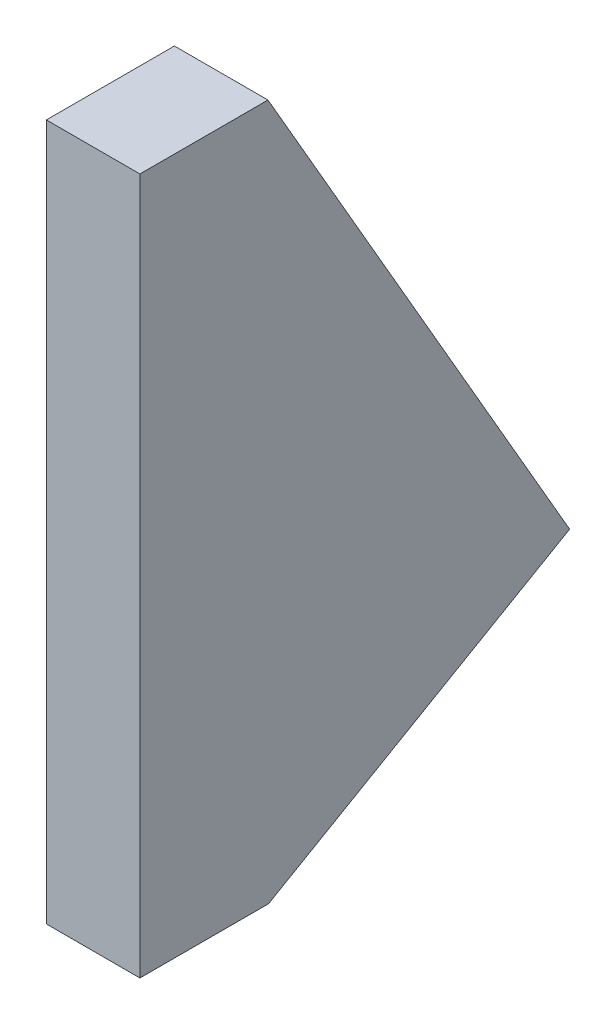
ISO-10303-21;
HEADER;
FILE_DESCRIPTION(('STEP AP214'),'2;1');
FILE_NAME('part.step','',(''),(''),'','','');
FILE_SCHEMA(('AUTOMOTIVE_DESIGN { 1 0 10303 214 1 1 1 1 }'));
ENDSEC;
DATA;
#1=APPLICATION_CONTEXT('core data for automotive mechanical design processes');
#2=APPLICATION_PROTOCOL_DEFINITION('international standard','automotive_design',2000,#1);
#3=PRODUCT_CONTEXT('',#1,'mechanical');
#4=PRODUCT('Part','Part','',(#3));
#5=PRODUCT_RELATED_PRODUCT_CATEGORY('part','',(#4));
#6=PRODUCT_DEFINITION_FORMATION('','',#4);
#7=PRODUCT_DEFINITION_CONTEXT('part definition',#1,'design');
#8=PRODUCT_DEFINITION('design','',#6,#7);
#9=PRODUCT_DEFINITION_SHAPE('','',#8);
#10=(LENGTH_UNIT() NAMED_UNIT(*) SI_UNIT(.MILLI.,.METRE.));
#11=(NAMED_UNIT(*) PLANE_ANGLE_UNIT() SI_UNIT($,.RADIAN.));
#12=(NAMED_UNIT(*) SI_UNIT($,.STERADIAN.) SOLID_ANGLE_UNIT());
#13=UNCERTAINTY_MEASURE_WITH_UNIT(LENGTH_MEASURE(1.E-05),#10,'distance_accuracy_value','');
#14=(GEOMETRIC_REPRESENTATION_CONTEXT(3) GLOBAL_UNCERTAINTY_ASSIGNED_CONTEXT((#13)) GLOBAL_UNIT_ASSIGNED_CONTEXT((#10,
#11,#12)) REPRESENTATION_CONTEXT('',''));
#15=CARTESIAN_POINT('',(0.,0.,0.));
#16=DIRECTION('',(0.,0.,1.));
#17=DIRECTION('',(1.,0.,0.));
#18=AXIS2_PLACEMENT_3D('',#15,#16,#17);
#19=CARTESIAN_POINT('',(3.175,-11.81399897,-0.0635));
#20=DIRECTION('',(0.,1.,0.));
#21=DIRECTION('',(0.,0.,1.));
#22=AXIS2_PLACEMENT_3D('',#19,#20,#21);
#23=PLANE('',#22);
#24=DIRECTION('',(0.,0.,-1.));
#25=VECTOR('',#24,1.);
#26=CARTESIAN_POINT('',(0.,-11.81399897,-0.0635));
#27=LINE('',#26,#25);
#28=CARTESIAN_POINT('',(0.,-11.81399897,-0.0635));
#29=VERTEX_POINT('',#28);
#30=CARTESIAN_POINT('',(0.,-11.81399897,-4.42798522627235));
#31=VERTEX_POINT('',#30);
#32=EDGE_CURVE('E112',#29,#31,#27,.T.);
#33=ORIENTED_EDGE('',*,*,#32,.T.);
#34=DIRECTION('',(-1.,0.,0.));
#35=VECTOR('',#34,1.);
#36=CARTESIAN_POINT('',(3.175,-11.81399897,-4.42798522627235));
#37=LINE('',#36,#35);
#38=CARTESIAN_POINT('',(3.175,-11.81399897,-4.42798522627235));
#39=VERTEX_POINT('',#38);
#40=EDGE_CURVE('E11',#39,#31,#37,.T.);
#41=ORIENTED_EDGE('',*,*,#40,.F.);
#42=DIRECTION('',(0.,0.,-1.));
#43=VECTOR('',#42,1.);
#44=CARTESIAN_POINT('',(3.175,-11.81399897,-0.0635));
#45=LINE('',#44,#43);
#46=CARTESIAN_POINT('',(3.175,-11.81399897,-0.0635));
#47=VERTEX_POINT('',#46);
#48=EDGE_CURVE('E122',#47,#39,#45,.T.);
#49=ORIENTED_EDGE('',*,*,#48,.F.);
#50=DIRECTION('',(-1.,0.,0.));
#51=VECTOR('',#50,1.);
#52=CARTESIAN_POINT('',(3.175,-11.81399897,-0.0635));
#53=LINE('',#52,#51);
#54=EDGE_CURVE('E53',#47,#29,#53,.T.);
#55=ORIENTED_EDGE('',*,*,#54,.T.);
#56=EDGE_LOOP('',(#33,#41,#49,#55));
#57=FACE_BOUND('',#56,.T.);
#58=ADVANCED_FACE('F37',(#57),#23,.F.);
#59=CARTESIAN_POINT('',(3.175,-11.81399897,-4.42798522627235));
#60=DIRECTION('',(0.,0.866025403662906,0.500000000210501));
#61=DIRECTION('',(0.,-0.500000000210501,0.866025403662906));
#62=AXIS2_PLACEMENT_3D('',#59,#60,#61);
#63=PLANE('',#62);
#64=DIRECTION('',(0.,0.500000000210501,-0.866025403662906));
#65=VECTOR('',#64,1.);
#66=CARTESIAN_POINT('',(0.,-11.81399897,-4.42798522627235));
#67=LINE('',#66,#65);
#68=CARTESIAN_POINT('',(0.,-5.91550686937283,-14.6444732268674));
#69=VERTEX_POINT('',#68);
#70=EDGE_CURVE('E114',#31,#69,#67,.T.);
#71=ORIENTED_EDGE('',*,*,#70,.T.);
#72=DIRECTION('',(-1.,0.,0.));
#73=VECTOR('',#72,1.);
#74=CARTESIAN_POINT('',(3.175,-5.91550686937283,-14.6444732268674));
#75=LINE('',#74,#73);
#76=CARTESIAN_POINT('',(3.175,-5.91550686937283,-14.6444732268674));
#77=VERTEX_POINT('',#76);
#78=EDGE_CURVE('E45',#77,#69,#75,.T.);
#79=ORIENTED_EDGE('',*,*,#78,.F.);
#80=DIRECTION('',(0.,0.500000000210501,-0.866025403662906));
#81=VECTOR('',#80,1.);
#82=CARTESIAN_POINT('',(3.175,-11.81399897,-4.42798522627235));
#83=LINE('',#82,#81);
#84=EDGE_CURVE('E83',#39,#77,#83,.T.);
#85=ORIENTED_EDGE('',*,*,#84,.F.);
#86=ORIENTED_EDGE('',*,*,#40,.T.);
#87=EDGE_LOOP('',(#71,#79,#85,#86));
#88=FACE_BOUND('',#87,.T.);
#89=ADVANCED_FACE('F137',(#88),#63,.F.);
#90=CARTESIAN_POINT('',(3.175,-5.91550686937283,-14.6444732268674));
#91=DIRECTION('',(0.,-0.5,0.866025403784438));
#92=DIRECTION('',(0.,-0.866025403784439,-0.5));
#93=AXIS2_PLACEMENT_3D('',#90,#91,#92);
#94=PLANE('',#93);
#95=DIRECTION('',(0.,0.866025403784439,0.5));
#96=VECTOR('',#95,1.);
#97=CARTESIAN_POINT('',(0.,-5.91550686937283,-14.6444732268674));
#98=LINE('',#97,#96);
#99=CARTESIAN_POINT('',(0.,11.81399897,-4.40833825790645));
#100=VERTEX_POINT('',#99);
#101=EDGE_CURVE('E102',#69,#100,#98,.T.);
#102=ORIENTED_EDGE('',*,*,#101,.T.);
#103=DIRECTION('',(-1.,0.,0.));
#104=VECTOR('',#103,1.);
#105=CARTESIAN_POINT('',(3.175,11.81399897,-4.40833825790645));
#106=LINE('',#105,#104);
#107=CARTESIAN_POINT('',(3.175,11.81399897,-4.40833825790645));
#108=VERTEX_POINT('',#107);
#109=EDGE_CURVE('E99',#108,#100,#106,.T.);
#110=ORIENTED_EDGE('',*,*,#109,.F.);
#111=DIRECTION('',(0.,0.866025403784439,0.5));
#112=VECTOR('',#111,1.);
#113=CARTESIAN_POINT('',(3.175,-5.91550686937283,-14.6444732268674));
#114=LINE('',#113,#112);
#115=EDGE_CURVE('E89',#77,#108,#114,.T.);
#116=ORIENTED_EDGE('',*,*,#115,.F.);
#117=ORIENTED_EDGE('',*,*,#78,.T.);
#118=EDGE_LOOP('',(#102,#110,#116,#117));
#119=FACE_BOUND('',#118,.T.);
#120=ADVANCED_FACE('F100',(#119),#94,.F.);
#121=CARTESIAN_POINT('',(3.175,11.81399897,-4.40833825790645));
#122=DIRECTION('',(0.,-1.,0.));
#123=DIRECTION('',(0.,0.,-1.));
#124=AXIS2_PLACEMENT_3D('',#121,#122,#123);
#125=PLANE('',#124);
#126=DIRECTION('',(0.,0.,1.));
#127=VECTOR('',#126,1.);
#128=CARTESIAN_POINT('',(0.,11.81399897,-4.40833825790645));
#129=LINE('',#128,#127);
#130=CARTESIAN_POINT('',(0.,11.81399897,-0.0635));
#131=VERTEX_POINT('',#130);
#132=EDGE_CURVE('E117',#100,#131,#129,.T.);
#133=ORIENTED_EDGE('',*,*,#132,.T.);
#134=DIRECTION('',(-1.,0.,0.));
#135=VECTOR('',#134,1.);
#136=CARTESIAN_POINT('',(3.175,11.81399897,-0.0635));
#137=LINE('',#136,#135);
#138=CARTESIAN_POINT('',(3.175,11.81399897,-0.0635));
#139=VERTEX_POINT('',#138);
#140=EDGE_CURVE('E71',#139,#131,#137,.T.);
#141=ORIENTED_EDGE('',*,*,#140,.F.);
#142=DIRECTION('',(0.,0.,1.));
#143=VECTOR('',#142,1.);
#144=CARTESIAN_POINT('',(3.175,11.81399897,-4.40833825790645));
#145=LINE('',#144,#143);
#146=EDGE_CURVE('E94',#108,#139,#145,.T.);
#147=ORIENTED_EDGE('',*,*,#146,.F.);
#148=ORIENTED_EDGE('',*,*,#109,.T.);
#149=EDGE_LOOP('',(#133,#141,#147,#148));
#150=FACE_BOUND('',#149,.T.);
#151=ADVANCED_FACE('F106',(#150),#125,.F.);
#152=CARTESIAN_POINT('',(3.175,-11.81399897,-0.0635));
#153=DIRECTION('',(0.,0.,1.));
#154=DIRECTION('',(1.,0.,0.));
#155=AXIS2_PLACEMENT_3D('',#152,#153,#154);
#156=PLANE('',#155);
#157=DIRECTION('',(0.,1.,0.));
#158=VECTOR('',#157,1.);
#159=CARTESIAN_POINT('',(0.,-11.81399897,-0.0635));
#160=LINE('',#159,#158);
#161=EDGE_CURVE('E119',#29,#131,#160,.T.);
#162=ORIENTED_EDGE('',*,*,#161,.F.);
#163=ORIENTED_EDGE('',*,*,#54,.F.);
#164=DIRECTION('',(0.,1.,0.));
#165=VECTOR('',#164,1.);
#166=CARTESIAN_POINT('',(3.175,-11.81399897,-0.0635));
#167=LINE('',#166,#165);
#168=EDGE_CURVE('E107',#47,#139,#167,.T.);
#169=ORIENTED_EDGE('',*,*,#168,.T.);
#170=ORIENTED_EDGE('',*,*,#140,.T.);
#171=EDGE_LOOP('',(#162,#163,#169,#170));
#172=FACE_BOUND('',#171,.T.);
#173=ADVANCED_FACE('F126',(#172),#156,.T.);
#174=CARTESIAN_POINT('',(3.175,0.,0.));
#175=DIRECTION('',(1.,0.,0.));
#176=DIRECTION('',(0.,0.,-1.));
#177=AXIS2_PLACEMENT_3D('',#174,#175,#176);
#178=PLANE('',#177);
#179=ORIENTED_EDGE('',*,*,#48,.T.);
#180=ORIENTED_EDGE('',*,*,#84,.T.);
#181=ORIENTED_EDGE('',*,*,#115,.T.);
#182=ORIENTED_EDGE('',*,*,#146,.T.);
#183=ORIENTED_EDGE('',*,*,#168,.F.);
#184=EDGE_LOOP('',(#179,#180,#181,#182,#183));
#185=FACE_BOUND('',#184,.T.);
#186=ADVANCED_FACE('F91',(#185),#178,.T.);
#187=CARTESIAN_POINT('',(0.,0.,0.));
#188=DIRECTION('',(1.,0.,0.));
#189=DIRECTION('',(0.,0.,-1.));
#190=AXIS2_PLACEMENT_3D('',#187,#188,#189);
#191=PLANE('',#190);
#192=ORIENTED_EDGE('',*,*,#32,.F.);
#193=ORIENTED_EDGE('',*,*,#161,.T.);
#194=ORIENTED_EDGE('',*,*,#132,.F.);
#195=ORIENTED_EDGE('',*,*,#101,.F.);
#196=ORIENTED_EDGE('',*,*,#70,.F.);
#197=EDGE_LOOP('',(#192,#193,#194,#195,#196));
#198=FACE_BOUND('',#197,.T.);
#199=ADVANCED_FACE('F125',(#198),#191,.F.);
#200=CLOSED_SHELL('',(#58,#89,#120,#151,#173,#186,#199));
#201=MANIFOLD_SOLID_BREP('B2',#200);
#202=ADVANCED_BREP_SHAPE_REPRESENTATION('',(#18,#201),#14);
#203=SHAPE_DEFINITION_REPRESENTATION(#9,#202);
ENDSEC;
END-ISO-10303-21;
